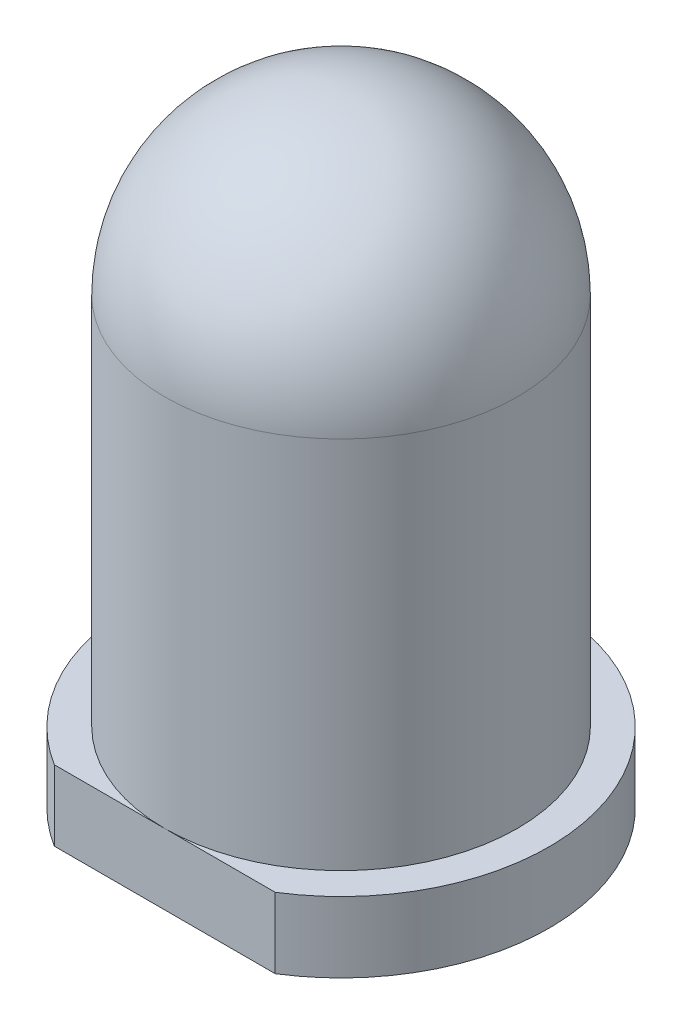
ISO-10303-21;
HEADER;
FILE_DESCRIPTION(('STEP AP214'),'2;1');
FILE_NAME('part.step','',(''),(''),'','','');
FILE_SCHEMA(('AUTOMOTIVE_DESIGN { 1 0 10303 214 1 1 1 1 }'));
ENDSEC;
DATA;
#1=APPLICATION_CONTEXT('core data for automotive mechanical design processes');
#2=APPLICATION_PROTOCOL_DEFINITION('international standard','automotive_design',2000,#1);
#3=PRODUCT_CONTEXT('',#1,'mechanical');
#4=PRODUCT('Part','Part','',(#3));
#5=PRODUCT_RELATED_PRODUCT_CATEGORY('part','',(#4));
#6=PRODUCT_DEFINITION_FORMATION('','',#4);
#7=PRODUCT_DEFINITION_CONTEXT('part definition',#1,'design');
#8=PRODUCT_DEFINITION('design','',#6,#7);
#9=PRODUCT_DEFINITION_SHAPE('','',#8);
#10=(LENGTH_UNIT() NAMED_UNIT(*) SI_UNIT(.MILLI.,.METRE.));
#11=(NAMED_UNIT(*) PLANE_ANGLE_UNIT() SI_UNIT($,.RADIAN.));
#12=(NAMED_UNIT(*) SI_UNIT($,.STERADIAN.) SOLID_ANGLE_UNIT());
#13=UNCERTAINTY_MEASURE_WITH_UNIT(LENGTH_MEASURE(1.E-05),#10,'distance_accuracy_value','');
#14=(GEOMETRIC_REPRESENTATION_CONTEXT(3) GLOBAL_UNCERTAINTY_ASSIGNED_CONTEXT((#13)) GLOBAL_UNIT_ASSIGNED_CONTEXT((#10,
#11,#12)) REPRESENTATION_CONTEXT('',''));
#15=CARTESIAN_POINT('',(0.,0.,0.));
#16=DIRECTION('',(0.,0.,1.));
#17=DIRECTION('',(1.,0.,0.));
#18=AXIS2_PLACEMENT_3D('',#15,#16,#17);
#19=CARTESIAN_POINT('',(0.,8.8,0.));
#20=DIRECTION('',(0.,-1.,0.));
#21=DIRECTION('',(0.,0.,-1.));
#22=AXIS2_PLACEMENT_3D('',#19,#20,#21);
#23=CYLINDRICAL_SURFACE('',#22,2.5);
#24=CARTESIAN_POINT('',(0.,1.,0.));
#25=DIRECTION('',(0.,1.,0.));
#26=DIRECTION('',(0.,0.,1.));
#27=AXIS2_PLACEMENT_3D('',#24,#25,#26);
#28=CIRCLE('',#27,2.5);
#29=CARTESIAN_POINT('',(0.,1.,2.5));
#30=VERTEX_POINT('',#29);
#31=EDGE_CURVE('E42',#30,#30,#28,.T.);
#32=ORIENTED_EDGE('',*,*,#31,.T.);
#33=EDGE_LOOP('',(#32));
#34=FACE_BOUND('',#33,.T.);
#35=CARTESIAN_POINT('',(0.,6.3,0.));
#36=DIRECTION('',(0.,1.,0.));
#37=DIRECTION('',(0.,0.,1.));
#38=AXIS2_PLACEMENT_3D('',#35,#36,#37);
#39=CIRCLE('',#38,2.5);
#40=CARTESIAN_POINT('',(0.,6.3,2.5));
#41=VERTEX_POINT('',#40);
#42=EDGE_CURVE('E74',#41,#41,#39,.T.);
#43=ORIENTED_EDGE('',*,*,#42,.F.);
#44=EDGE_LOOP('',(#43));
#45=FACE_BOUND('',#44,.T.);
#46=ADVANCED_FACE('F34',(#34,#45),#23,.T.);
#47=CARTESIAN_POINT('',(0.,1.,0.));
#48=DIRECTION('',(0.,-1.,0.));
#49=DIRECTION('',(0.,0.,-1.));
#50=AXIS2_PLACEMENT_3D('',#47,#48,#49);
#51=CYLINDRICAL_SURFACE('',#50,2.95);
#52=CARTESIAN_POINT('',(0.,1.,0.));
#53=DIRECTION('',(0.,1.,0.));
#54=DIRECTION('',(0.,0.,1.));
#55=AXIS2_PLACEMENT_3D('',#52,#53,#54);
#56=CIRCLE('',#55,2.95);
#57=CARTESIAN_POINT('',(1.56604597633658,1.,2.5));
#58=VERTEX_POINT('',#57);
#59=CARTESIAN_POINT('',(-1.56604597633658,1.,2.5));
#60=VERTEX_POINT('',#59);
#61=EDGE_CURVE('E73',#58,#60,#56,.T.);
#62=ORIENTED_EDGE('',*,*,#61,.F.);
#63=DIRECTION('',(0.,-1.,0.));
#64=VECTOR('',#63,1.);
#65=CARTESIAN_POINT('',(1.56604597633658,1.,2.5));
#66=LINE('',#65,#64);
#67=CARTESIAN_POINT('',(1.56604597633658,0.,2.5));
#68=VERTEX_POINT('',#67);
#69=EDGE_CURVE('E64',#58,#68,#66,.T.);
#70=ORIENTED_EDGE('',*,*,#69,.T.);
#71=CARTESIAN_POINT('',(0.,0.,0.));
#72=DIRECTION('',(0.,1.,0.));
#73=DIRECTION('',(0.,0.,1.));
#74=AXIS2_PLACEMENT_3D('',#71,#72,#73);
#75=CIRCLE('',#74,2.95);
#76=CARTESIAN_POINT('',(-1.56604597633658,0.,2.5));
#77=VERTEX_POINT('',#76);
#78=EDGE_CURVE('E71',#68,#77,#75,.T.);
#79=ORIENTED_EDGE('',*,*,#78,.T.);
#80=DIRECTION('',(0.,-1.,0.));
#81=VECTOR('',#80,1.);
#82=CARTESIAN_POINT('',(-1.56604597633658,1.,2.5));
#83=LINE('',#82,#81);
#84=EDGE_CURVE('E49',#77,#60,#83,.F.);
#85=ORIENTED_EDGE('',*,*,#84,.T.);
#86=EDGE_LOOP('',(#62,#70,#79,#85));
#87=FACE_BOUND('',#86,.T.);
#88=ADVANCED_FACE('F36',(#87),#51,.T.);
#89=CARTESIAN_POINT('',(0.,1.,0.));
#90=DIRECTION('',(0.,1.,0.));
#91=DIRECTION('',(0.,0.,1.));
#92=AXIS2_PLACEMENT_3D('',#89,#90,#91);
#93=PLANE('',#92);
#94=DIRECTION('',(-1.,0.,0.));
#95=VECTOR('',#94,1.);
#96=CARTESIAN_POINT('',(0.,1.,2.5));
#97=LINE('',#96,#95);
#98=EDGE_CURVE('E84',#58,#30,#97,.T.);
#99=ORIENTED_EDGE('',*,*,#98,.F.);
#100=ORIENTED_EDGE('',*,*,#61,.T.);
#101=EDGE_CURVE('E85',#30,#60,#97,.T.);
#102=ORIENTED_EDGE('',*,*,#101,.F.);
#103=ORIENTED_EDGE('',*,*,#31,.F.);
#104=EDGE_LOOP('',(#99,#100,#102,#103));
#105=FACE_BOUND('',#104,.T.);
#106=ADVANCED_FACE('F89',(#105),#93,.T.);
#107=CARTESIAN_POINT('',(0.,0.,0.));
#108=DIRECTION('',(0.,1.,0.));
#109=DIRECTION('',(0.,0.,1.));
#110=AXIS2_PLACEMENT_3D('',#107,#108,#109);
#111=PLANE('',#110);
#112=ORIENTED_EDGE('',*,*,#78,.F.);
#113=DIRECTION('',(-1.,0.,0.));
#114=VECTOR('',#113,1.);
#115=CARTESIAN_POINT('',(0.,0.,2.5));
#116=LINE('',#115,#114);
#117=EDGE_CURVE('E11',#68,#77,#116,.T.);
#118=ORIENTED_EDGE('',*,*,#117,.T.);
#119=EDGE_LOOP('',(#112,#118));
#120=FACE_BOUND('',#119,.T.);
#121=ADVANCED_FACE('F76',(#120),#111,.F.);
#122=CARTESIAN_POINT('',(0.,6.3,0.));
#123=DIRECTION('',(0.,1.,0.));
#124=DIRECTION('',(0.,0.,1.));
#125=AXIS2_PLACEMENT_3D('',#122,#123,#124);
#126=SPHERICAL_SURFACE('',#125,2.5);
#127=CARTESIAN_POINT('',(0.,8.8,0.));
#128=VERTEX_POINT('',#127);
#129=VERTEX_LOOP('',#128);
#130=FACE_BOUND('',#129,.T.);
#131=ORIENTED_EDGE('',*,*,#42,.T.);
#132=EDGE_LOOP('',(#131));
#133=FACE_BOUND('',#132,.T.);
#134=ADVANCED_FACE('F96',(#130,#133),#126,.T.);
#135=CARTESIAN_POINT('',(-6.72965166742459,0.,2.5));
#136=DIRECTION('',(0.,0.,-1.));
#137=DIRECTION('',(-1.,0.,0.));
#138=AXIS2_PLACEMENT_3D('',#135,#136,#137);
#139=PLANE('',#138);
#140=ORIENTED_EDGE('',*,*,#98,.T.);
#141=ORIENTED_EDGE('',*,*,#101,.T.);
#142=ORIENTED_EDGE('',*,*,#84,.F.);
#143=ORIENTED_EDGE('',*,*,#117,.F.);
#144=ORIENTED_EDGE('',*,*,#69,.F.);
#145=EDGE_LOOP('',(#140,#141,#142,#143,#144));
#146=FACE_BOUND('',#145,.T.);
#147=ADVANCED_FACE('F63',(#146),#139,.F.);
#148=CLOSED_SHELL('',(#46,#88,#106,#121,#134,#147));
#149=MANIFOLD_SOLID_BREP('B2',#148);
#150=ADVANCED_BREP_SHAPE_REPRESENTATION('',(#18,#149),#14);
#151=SHAPE_DEFINITION_REPRESENTATION(#9,#150);
ENDSEC;
END-ISO-10303-21;
